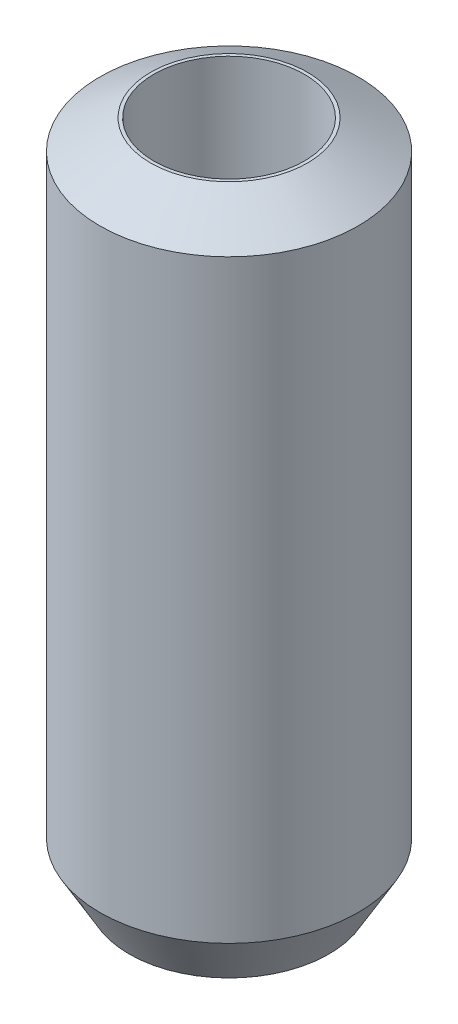
ISO-10303-21;
HEADER;
FILE_DESCRIPTION(('STEP AP214'),'2;1');
FILE_NAME('part.step','',(''),(''),'','','');
FILE_SCHEMA(('AUTOMOTIVE_DESIGN { 1 0 10303 214 1 1 1 1 }'));
ENDSEC;
DATA;
#1=APPLICATION_CONTEXT('core data for automotive mechanical design processes');
#2=APPLICATION_PROTOCOL_DEFINITION('international standard','automotive_design',2000,#1);
#3=PRODUCT_CONTEXT('',#1,'mechanical');
#4=PRODUCT('Part','Part','',(#3));
#5=PRODUCT_RELATED_PRODUCT_CATEGORY('part','',(#4));
#6=PRODUCT_DEFINITION_FORMATION('','',#4);
#7=PRODUCT_DEFINITION_CONTEXT('part definition',#1,'design');
#8=PRODUCT_DEFINITION('design','',#6,#7);
#9=PRODUCT_DEFINITION_SHAPE('','',#8);
#10=(LENGTH_UNIT() NAMED_UNIT(*) SI_UNIT(.MILLI.,.METRE.));
#11=(NAMED_UNIT(*) PLANE_ANGLE_UNIT() SI_UNIT($,.RADIAN.));
#12=(NAMED_UNIT(*) SI_UNIT($,.STERADIAN.) SOLID_ANGLE_UNIT());
#13=UNCERTAINTY_MEASURE_WITH_UNIT(LENGTH_MEASURE(1.E-05),#10,'distance_accuracy_value','');
#14=(GEOMETRIC_REPRESENTATION_CONTEXT(3) GLOBAL_UNCERTAINTY_ASSIGNED_CONTEXT((#13)) GLOBAL_UNIT_ASSIGNED_CONTEXT((#10,
#11,#12)) REPRESENTATION_CONTEXT('',''));
#15=CARTESIAN_POINT('',(0.,0.,0.));
#16=DIRECTION('',(0.,0.,1.));
#17=DIRECTION('',(1.,0.,0.));
#18=AXIS2_PLACEMENT_3D('',#15,#16,#17);
#19=CARTESIAN_POINT('',(0.,65.2755741032941,0.));
#20=DIRECTION('',(0.,-1.,0.));
#21=DIRECTION('',(0.,0.,-1.));
#22=AXIS2_PLACEMENT_3D('',#19,#20,#21);
#23=CYLINDRICAL_SURFACE('',#22,12.5);
#24=CARTESIAN_POINT('',(0.,62.4481377044138,0.));
#25=DIRECTION('',(0.,1.,0.));
#26=DIRECTION('',(0.,0.,1.));
#27=AXIS2_PLACEMENT_3D('',#24,#25,#26);
#28=CIRCLE('',#27,12.5);
#29=CARTESIAN_POINT('',(0.,62.4481377044138,12.5));
#30=VERTEX_POINT('',#29);
#31=EDGE_CURVE('E50',#30,#30,#28,.F.);
#32=ORIENTED_EDGE('',*,*,#31,.T.);
#33=EDGE_LOOP('',(#32));
#34=FACE_BOUND('',#33,.T.);
#35=CARTESIAN_POINT('',(0.,4.89726349803014,0.));
#36=DIRECTION('',(0.,1.,0.));
#37=DIRECTION('',(0.,0.,1.));
#38=AXIS2_PLACEMENT_3D('',#35,#36,#37);
#39=CIRCLE('',#38,12.5);
#40=CARTESIAN_POINT('',(0.,4.89726349803014,12.5));
#41=VERTEX_POINT('',#40);
#42=EDGE_CURVE('E51',#41,#41,#39,.T.);
#43=ORIENTED_EDGE('',*,*,#42,.T.);
#44=EDGE_LOOP('',(#43));
#45=FACE_BOUND('',#44,.T.);
#46=ADVANCED_FACE('F39',(#34,#45),#23,.T.);
#47=CARTESIAN_POINT('',(0.,65.2755741032941,0.));
#48=DIRECTION('',(0.,1.,0.));
#49=DIRECTION('',(0.,0.,1.));
#50=AXIS2_PLACEMENT_3D('',#47,#48,#49);
#51=PLANE('',#50);
#52=CARTESIAN_POINT('',(0.,65.2755741032941,0.));
#53=DIRECTION('',(0.,1.,0.));
#54=DIRECTION('',(0.,0.,1.));
#55=AXIS2_PLACEMENT_3D('',#52,#53,#54);
#56=CIRCLE('',#55,7.60273650196983);
#57=CARTESIAN_POINT('',(0.,65.2755741032941,7.60273650196983));
#58=VERTEX_POINT('',#57);
#59=EDGE_CURVE('E54',#58,#58,#56,.T.);
#60=ORIENTED_EDGE('',*,*,#59,.T.);
#61=EDGE_LOOP('',(#60));
#62=FACE_BOUND('',#61,.T.);
#63=CARTESIAN_POINT('',(0.,65.2755741032941,0.));
#64=DIRECTION('',(0.,1.,0.));
#65=DIRECTION('',(0.,0.,1.));
#66=AXIS2_PLACEMENT_3D('',#63,#64,#65);
#67=CIRCLE('',#66,7.28651878598231);
#68=CARTESIAN_POINT('',(0.,65.2755741032941,7.28651878598231));
#69=VERTEX_POINT('',#68);
#70=EDGE_CURVE('E58',#69,#69,#67,.T.);
#71=ORIENTED_EDGE('',*,*,#70,.F.);
#72=EDGE_LOOP('',(#71));
#73=FACE_BOUND('',#72,.T.);
#74=ADVANCED_FACE('F69',(#62,#73),#51,.T.);
#75=CARTESIAN_POINT('',(0.,0.,0.));
#76=DIRECTION('',(0.,1.,0.));
#77=DIRECTION('',(0.,0.,1.));
#78=AXIS2_PLACEMENT_3D('',#75,#76,#77);
#79=PLANE('',#78);
#80=CARTESIAN_POINT('',(0.,0.,0.));
#81=DIRECTION('',(0.,1.,0.));
#82=DIRECTION('',(0.,0.,1.));
#83=AXIS2_PLACEMENT_3D('',#80,#81,#82);
#84=CIRCLE('',#83,9.67256360111974);
#85=CARTESIAN_POINT('',(0.,0.,9.67256360111974));
#86=VERTEX_POINT('',#85);
#87=EDGE_CURVE('E10',#86,#86,#84,.F.);
#88=ORIENTED_EDGE('',*,*,#87,.T.);
#89=EDGE_LOOP('',(#88));
#90=FACE_BOUND('',#89,.T.);
#91=CARTESIAN_POINT('',(0.,0.,0.));
#92=DIRECTION('',(0.,1.,0.));
#93=DIRECTION('',(0.,0.,1.));
#94=AXIS2_PLACEMENT_3D('',#91,#92,#93);
#95=CIRCLE('',#94,7.28651878598231);
#96=CARTESIAN_POINT('',(0.,0.,7.28651878598231));
#97=VERTEX_POINT('',#96);
#98=EDGE_CURVE('E63',#97,#97,#95,.T.);
#99=ORIENTED_EDGE('',*,*,#98,.T.);
#100=EDGE_LOOP('',(#99));
#101=FACE_BOUND('',#100,.T.);
#102=ADVANCED_FACE('F75',(#90,#101),#79,.F.);
#103=CARTESIAN_POINT('',(0.,65.2755741032941,0.));
#104=DIRECTION('',(0.,-1.,0.));
#105=DIRECTION('',(0.,0.,-1.));
#106=AXIS2_PLACEMENT_3D('',#103,#104,#105);
#107=CYLINDRICAL_SURFACE('',#106,7.28651878598231);
#108=ORIENTED_EDGE('',*,*,#70,.T.);
#109=EDGE_LOOP('',(#108));
#110=FACE_BOUND('',#109,.T.);
#111=ORIENTED_EDGE('',*,*,#98,.F.);
#112=EDGE_LOOP('',(#111));
#113=FACE_BOUND('',#112,.T.);
#114=ADVANCED_FACE('F70',(#110,#113),#107,.F.);
#115=CARTESIAN_POINT('',(0.,65.2755741032941,0.));
#116=DIRECTION('',(0.,-1.,0.));
#117=DIRECTION('',(0.,0.,-1.));
#118=AXIS2_PLACEMENT_3D('',#115,#116,#117);
#119=CONICAL_SURFACE('',#118,7.60273650196983,1.04719755119659);
#120=ORIENTED_EDGE('',*,*,#31,.F.);
#121=EDGE_LOOP('',(#120));
#122=FACE_BOUND('',#121,.T.);
#123=ORIENTED_EDGE('',*,*,#59,.F.);
#124=EDGE_LOOP('',(#123));
#125=FACE_BOUND('',#124,.T.);
#126=ADVANCED_FACE('F81',(#122,#125),#119,.T.);
#127=CARTESIAN_POINT('',(0.,4.89726349803014,0.));
#128=DIRECTION('',(0.,1.,0.));
#129=DIRECTION('',(0.,0.,1.));
#130=AXIS2_PLACEMENT_3D('',#127,#128,#129);
#131=CONICAL_SURFACE('',#130,12.5,0.523598775598303);
#132=ORIENTED_EDGE('',*,*,#87,.F.);
#133=EDGE_LOOP('',(#132));
#134=FACE_BOUND('',#133,.T.);
#135=ORIENTED_EDGE('',*,*,#42,.F.);
#136=EDGE_LOOP('',(#135));
#137=FACE_BOUND('',#136,.T.);
#138=ADVANCED_FACE('F45',(#134,#137),#131,.T.);
#139=CLOSED_SHELL('',(#46,#74,#102,#114,#126,#138));
#140=MANIFOLD_SOLID_BREP('B2',#139);
#141=ADVANCED_BREP_SHAPE_REPRESENTATION('',(#18,#140),#14);
#142=SHAPE_DEFINITION_REPRESENTATION(#9,#141);
ENDSEC;
END-ISO-10303-21;
